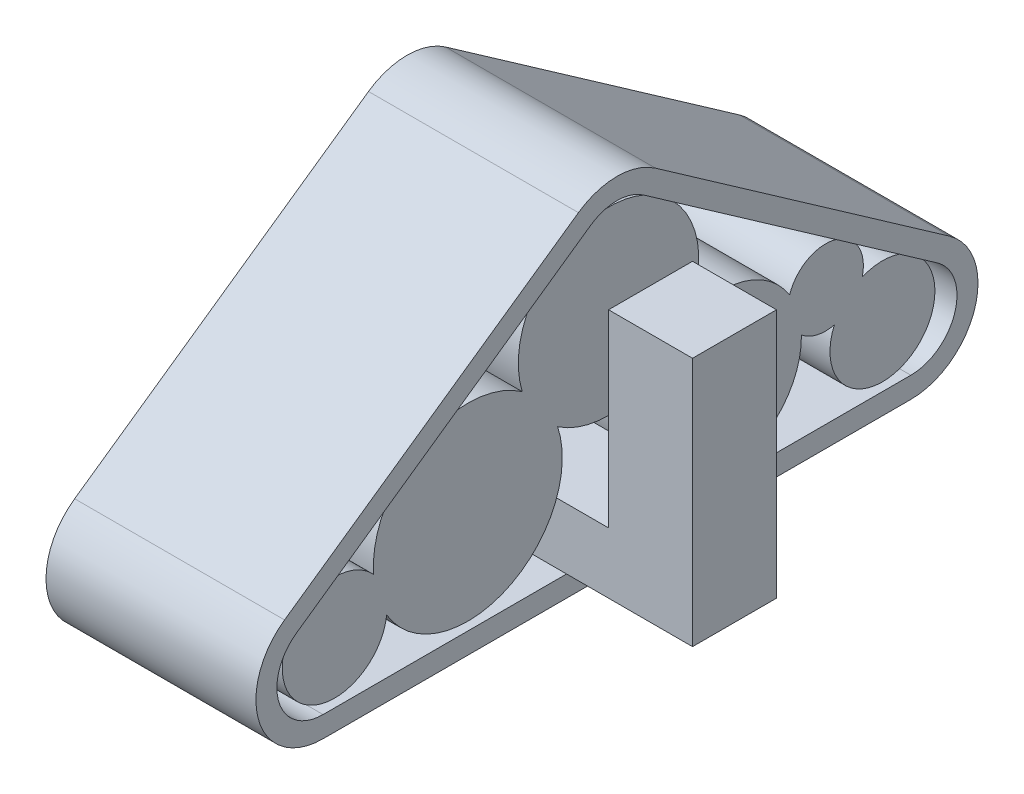
ISO-10303-21;
HEADER;
FILE_DESCRIPTION(('STEP AP214'),'2;1');
FILE_NAME('part.step','',(''),(''),'','','');
FILE_SCHEMA(('AUTOMOTIVE_DESIGN { 1 0 10303 214 1 1 1 1 }'));
ENDSEC;
DATA;
#1=APPLICATION_CONTEXT('core data for automotive mechanical design processes');
#2=APPLICATION_PROTOCOL_DEFINITION('international standard','automotive_design',2000,#1);
#3=PRODUCT_CONTEXT('',#1,'mechanical');
#4=PRODUCT('Part','Part','',(#3));
#5=PRODUCT_RELATED_PRODUCT_CATEGORY('part','',(#4));
#6=PRODUCT_DEFINITION_FORMATION('','',#4);
#7=PRODUCT_DEFINITION_CONTEXT('part definition',#1,'design');
#8=PRODUCT_DEFINITION('design','',#6,#7);
#9=PRODUCT_DEFINITION_SHAPE('','',#8);
#10=(LENGTH_UNIT() NAMED_UNIT(*) SI_UNIT(.MILLI.,.METRE.));
#11=(NAMED_UNIT(*) PLANE_ANGLE_UNIT() SI_UNIT($,.RADIAN.));
#12=(NAMED_UNIT(*) SI_UNIT($,.STERADIAN.) SOLID_ANGLE_UNIT());
#13=UNCERTAINTY_MEASURE_WITH_UNIT(LENGTH_MEASURE(1.E-05),#10,'distance_accuracy_value','');
#14=(GEOMETRIC_REPRESENTATION_CONTEXT(3) GLOBAL_UNCERTAINTY_ASSIGNED_CONTEXT((#13)) GLOBAL_UNIT_ASSIGNED_CONTEXT((#10,
#11,#12)) REPRESENTATION_CONTEXT('',''));
#15=CARTESIAN_POINT('',(0.,0.,0.));
#16=DIRECTION('',(0.,0.,1.));
#17=DIRECTION('',(1.,0.,0.));
#18=AXIS2_PLACEMENT_3D('',#15,#16,#17);
#19=CARTESIAN_POINT('',(0.1,0.,0.));
#20=DIRECTION('',(1.,0.,0.));
#21=DIRECTION('',(0.,0.,-1.));
#22=AXIS2_PLACEMENT_3D('',#19,#20,#21);
#23=PLANE('',#22);
#24=CARTESIAN_POINT('',(0.1,2.6098197246342,0.));
#25=DIRECTION('',(1.,0.,0.));
#26=DIRECTION('',(0.,0.,-1.));
#27=AXIS2_PLACEMENT_3D('',#24,#25,#26);
#28=CIRCLE('',#27,1.075);
#29=CARTESIAN_POINT('',(0.1,1.72204305705104,0.606199297669457));
#30=VERTEX_POINT('',#29);
#31=CARTESIAN_POINT('',(0.1,1.66976450324786,-0.521460622429232));
#32=VERTEX_POINT('',#31);
#33=EDGE_CURVE('E663',#30,#32,#28,.T.);
#34=ORIENTED_EDGE('',*,*,#33,.F.);
#35=CARTESIAN_POINT('',(0.1,1.375,1.67633298864114));
#36=DIRECTION('',(1.,0.,0.));
#37=DIRECTION('',(0.,0.,-1.));
#38=AXIS2_PLACEMENT_3D('',#35,#36,#37);
#39=CIRCLE('',#38,1.125);
#40=CARTESIAN_POINT('',(0.1,0.797718656971334,2.64192671842143));
#41=VERTEX_POINT('',#40);
#42=EDGE_CURVE('E689',#41,#30,#39,.T.);
#43=ORIENTED_EDGE('',*,*,#42,.F.);
#44=CARTESIAN_POINT('',(0.1,0.875000000000002,3.26213038982276));
#45=DIRECTION('',(1.,0.,0.));
#46=DIRECTION('',(0.,0.,-1.));
#47=AXIS2_PLACEMENT_3D('',#44,#45,#46);
#48=CIRCLE('',#47,0.625);
#49=CARTESIAN_POINT('',(0.1,1.29403938178154,2.79841604184963));
#50=VERTEX_POINT('',#49);
#51=EDGE_CURVE('E586',#50,#41,#48,.T.);
#52=ORIENTED_EDGE('',*,*,#51,.F.);
#53=CARTESIAN_POINT('',(0.1,2.29411096497886,1.02759572745165));
#54=VERTEX_POINT('',#53);
#55=EDGE_CURVE('E691',#54,#50,#39,.T.);
#56=ORIENTED_EDGE('',*,*,#55,.F.);
#57=CARTESIAN_POINT('',(0.1,2.04620627521986,-0.915404216529112));
#58=VERTEX_POINT('',#57);
#59=EDGE_CURVE('E734',#58,#54,#28,.T.);
#60=ORIENTED_EDGE('',*,*,#59,.F.);
#61=CARTESIAN_POINT('',(0.1,1.2,-1.34718534138119));
#62=DIRECTION('',(1.,0.,0.));
#63=DIRECTION('',(0.,0.,-1.));
#64=AXIS2_PLACEMENT_3D('',#61,#62,#63);
#65=CIRCLE('',#64,0.950000000000001);
#66=CARTESIAN_POINT('',(0.1,1.69821343428876,-2.15606318994314));
#67=VERTEX_POINT('',#66);
#68=EDGE_CURVE('E724',#67,#58,#65,.T.);
#69=ORIENTED_EDGE('',*,*,#68,.F.);
#70=CARTESIAN_POINT('',(0.1,1.56265537250669,-2.5851599294855));
#71=DIRECTION('',(1.,0.,0.));
#72=DIRECTION('',(0.,0.,-1.));
#73=AXIS2_PLACEMENT_3D('',#70,#71,#72);
#74=CIRCLE('',#73,0.45);
#75=CARTESIAN_POINT('',(0.1,1.45172587783847,-3.02127304235033));
#76=VERTEX_POINT('',#75);
#77=EDGE_CURVE('E729',#76,#67,#74,.T.);
#78=ORIENTED_EDGE('',*,*,#77,.F.);
#79=CARTESIAN_POINT('',(0.1,0.875000000000002,-3.26213038982276));
#80=DIRECTION('',(1.,0.,0.));
#81=DIRECTION('',(0.,0.,-1.));
#82=AXIS2_PLACEMENT_3D('',#79,#80,#81);
#83=CIRCLE('',#82,0.625);
#84=CARTESIAN_POINT('',(0.1,1.124858698694,-2.68924677975266));
#85=VERTEX_POINT('',#84);
#86=EDGE_CURVE('E728',#76,#85,#83,.F.);
#87=ORIENTED_EDGE('',*,*,#86,.T.);
#88=CARTESIAN_POINT('',(0.1,1.2169921219537,-2.2970333649047));
#89=VERTEX_POINT('',#88);
#90=EDGE_CURVE('E723',#89,#85,#74,.T.);
#91=ORIENTED_EDGE('',*,*,#90,.F.);
#92=EDGE_CURVE('E720',#32,#89,#65,.T.);
#93=ORIENTED_EDGE('',*,*,#92,.F.);
#94=EDGE_LOOP('',(#34,#43,#52,#56,#60,#69,#78,#87,#91,#93));
#95=FACE_BOUND('',#94,.T.);
#96=ADVANCED_FACE('F567',(#95),#23,.F.);
#97=CARTESIAN_POINT('',(2.4,2.6098197246342,0.));
#98=DIRECTION('',(-1.,0.,0.));
#99=DIRECTION('',(0.,0.,1.));
#100=AXIS2_PLACEMENT_3D('',#97,#98,#99);
#101=CYLINDRICAL_SURFACE('',#100,1.075);
#102=DIRECTION('',(-1.,0.,0.));
#103=VECTOR('',#102,1.);
#104=CARTESIAN_POINT('',(2.4,1.72204305705104,0.606199297669457));
#105=LINE('',#104,#103);
#106=CARTESIAN_POINT('',(2.4,1.72204305705104,0.606199297669456));
#107=VERTEX_POINT('',#106);
#108=EDGE_CURVE('E700',#107,#30,#105,.T.);
#109=ORIENTED_EDGE('',*,*,#108,.T.);
#110=ORIENTED_EDGE('',*,*,#33,.T.);
#111=DIRECTION('',(-1.,0.,0.));
#112=VECTOR('',#111,1.);
#113=CARTESIAN_POINT('',(2.4,1.66976450324786,-0.521460622429232));
#114=LINE('',#113,#112);
#115=CARTESIAN_POINT('',(2.4,1.66976450324786,-0.521460622429232));
#116=VERTEX_POINT('',#115);
#117=EDGE_CURVE('E656',#116,#32,#114,.T.);
#118=ORIENTED_EDGE('',*,*,#117,.F.);
#119=CARTESIAN_POINT('',(2.4,2.6098197246342,0.));
#120=DIRECTION('',(1.,0.,0.));
#121=DIRECTION('',(0.,0.,-1.));
#122=AXIS2_PLACEMENT_3D('',#119,#120,#121);
#123=CIRCLE('',#122,1.075);
#124=EDGE_CURVE('E660',#107,#116,#123,.T.);
#125=ORIENTED_EDGE('',*,*,#124,.F.);
#126=EDGE_LOOP('',(#109,#110,#118,#125));
#127=FACE_BOUND('',#126,.T.);
#128=ADVANCED_FACE('F658',(#127),#101,.T.);
#129=CARTESIAN_POINT('',(2.4,0.,0.));
#130=DIRECTION('',(1.,0.,0.));
#131=DIRECTION('',(0.,0.,-1.));
#132=AXIS2_PLACEMENT_3D('',#129,#130,#131);
#133=PLANE('',#132);
#134=CARTESIAN_POINT('',(2.4,2.04620627521986,-0.915404216529112));
#135=VERTEX_POINT('',#134);
#136=CARTESIAN_POINT('',(2.4,2.29411096497886,1.02759572745165));
#137=VERTEX_POINT('',#136);
#138=EDGE_CURVE('E685',#135,#137,#123,.T.);
#139=ORIENTED_EDGE('',*,*,#138,.T.);
#140=CARTESIAN_POINT('',(2.4,1.375,1.67633298864114));
#141=DIRECTION('',(1.,0.,0.));
#142=DIRECTION('',(0.,0.,-1.));
#143=AXIS2_PLACEMENT_3D('',#140,#141,#142);
#144=CIRCLE('',#143,1.125);
#145=CARTESIAN_POINT('',(2.4,1.29403938178154,2.79841604184963));
#146=VERTEX_POINT('',#145);
#147=EDGE_CURVE('E696',#137,#146,#144,.T.);
#148=ORIENTED_EDGE('',*,*,#147,.T.);
#149=CARTESIAN_POINT('',(2.4,0.875000000000002,3.26213038982276));
#150=DIRECTION('',(1.,0.,0.));
#151=DIRECTION('',(0.,0.,-1.));
#152=AXIS2_PLACEMENT_3D('',#149,#150,#151);
#153=CIRCLE('',#152,0.625);
#154=CARTESIAN_POINT('',(2.4,0.797718656971334,2.64192671842143));
#155=VERTEX_POINT('',#154);
#156=EDGE_CURVE('E706',#146,#155,#153,.T.);
#157=ORIENTED_EDGE('',*,*,#156,.T.);
#158=EDGE_CURVE('E683',#155,#107,#144,.T.);
#159=ORIENTED_EDGE('',*,*,#158,.T.);
#160=ORIENTED_EDGE('',*,*,#124,.T.);
#161=CARTESIAN_POINT('',(2.4,1.2,-1.34718534138119));
#162=DIRECTION('',(1.,0.,0.));
#163=DIRECTION('',(0.,0.,-1.));
#164=AXIS2_PLACEMENT_3D('',#161,#162,#163);
#165=CIRCLE('',#164,0.950000000000001);
#166=CARTESIAN_POINT('',(2.4,1.2169921219537,-2.2970333649047));
#167=VERTEX_POINT('',#166);
#168=EDGE_CURVE('E670',#116,#167,#165,.T.);
#169=ORIENTED_EDGE('',*,*,#168,.T.);
#170=CARTESIAN_POINT('',(2.4,1.56265537250669,-2.5851599294855));
#171=DIRECTION('',(1.,0.,0.));
#172=DIRECTION('',(0.,0.,-1.));
#173=AXIS2_PLACEMENT_3D('',#170,#171,#172);
#174=CIRCLE('',#173,0.45);
#175=CARTESIAN_POINT('',(2.4,1.124858698694,-2.68924677975266));
#176=VERTEX_POINT('',#175);
#177=EDGE_CURVE('E676',#167,#176,#174,.T.);
#178=ORIENTED_EDGE('',*,*,#177,.T.);
#179=CARTESIAN_POINT('',(2.4,0.875000000000002,-3.26213038982276));
#180=DIRECTION('',(1.,0.,0.));
#181=DIRECTION('',(0.,0.,-1.));
#182=AXIS2_PLACEMENT_3D('',#179,#180,#181);
#183=CIRCLE('',#182,0.625);
#184=CARTESIAN_POINT('',(2.4,1.45172587783847,-3.02127304235033));
#185=VERTEX_POINT('',#184);
#186=EDGE_CURVE('E715',#185,#176,#183,.F.);
#187=ORIENTED_EDGE('',*,*,#186,.F.);
#188=CARTESIAN_POINT('',(2.4,1.69821343428876,-2.15606318994314));
#189=VERTEX_POINT('',#188);
#190=EDGE_CURVE('E716',#185,#189,#174,.T.);
#191=ORIENTED_EDGE('',*,*,#190,.T.);
#192=EDGE_CURVE('E678',#189,#135,#165,.T.);
#193=ORIENTED_EDGE('',*,*,#192,.T.);
#194=EDGE_LOOP('',(#139,#148,#157,#159,#160,#169,#178,#187,#191,#193));
#195=FACE_BOUND('',#194,.T.);
#196=ADVANCED_FACE('F680',(#195),#133,.T.);
#197=DIRECTION('',(-1.,0.,0.));
#198=VECTOR('',#197,1.);
#199=CARTESIAN_POINT('',(2.4,2.04620627521986,-0.915404216529112));
#200=LINE('',#199,#198);
#201=EDGE_CURVE('E630',#135,#58,#200,.T.);
#202=ORIENTED_EDGE('',*,*,#201,.T.);
#203=ORIENTED_EDGE('',*,*,#59,.T.);
#204=DIRECTION('',(-1.,0.,0.));
#205=VECTOR('',#204,1.);
#206=CARTESIAN_POINT('',(2.4,2.29411096497886,1.02759572745165));
#207=LINE('',#206,#205);
#208=EDGE_CURVE('E703',#137,#54,#207,.T.);
#209=ORIENTED_EDGE('',*,*,#208,.F.);
#210=ORIENTED_EDGE('',*,*,#138,.F.);
#211=EDGE_LOOP('',(#202,#203,#209,#210));
#212=FACE_BOUND('',#211,.T.);
#213=ADVANCED_FACE('F777',(#212),#101,.T.);
#214=CARTESIAN_POINT('',(0.1,0.875000000000002,-3.26213038982276));
#215=DIRECTION('',(1.,0.,0.));
#216=DIRECTION('',(0.,0.,-1.));
#217=AXIS2_PLACEMENT_3D('',#214,#215,#216);
#218=CYLINDRICAL_SURFACE('',#217,0.625);
#219=DIRECTION('',(1.,0.,0.));
#220=VECTOR('',#219,1.);
#221=CARTESIAN_POINT('',(0.1,1.45172587783847,-3.02127304235033));
#222=LINE('',#221,#220);
#223=EDGE_CURVE('E614',#76,#185,#222,.T.);
#224=ORIENTED_EDGE('',*,*,#223,.T.);
#225=ORIENTED_EDGE('',*,*,#186,.T.);
#226=DIRECTION('',(1.,0.,0.));
#227=VECTOR('',#226,1.);
#228=CARTESIAN_POINT('',(0.1,1.124858698694,-2.68924677975266));
#229=LINE('',#228,#227);
#230=EDGE_CURVE('E736',#85,#176,#229,.T.);
#231=ORIENTED_EDGE('',*,*,#230,.F.);
#232=ORIENTED_EDGE('',*,*,#86,.F.);
#233=EDGE_LOOP('',(#224,#225,#231,#232));
#234=FACE_BOUND('',#233,.T.);
#235=ADVANCED_FACE('F569',(#234),#218,.T.);
#236=CARTESIAN_POINT('',(0.1,1.56265537250669,-2.5851599294855));
#237=DIRECTION('',(1.,0.,0.));
#238=DIRECTION('',(0.,0.,-1.));
#239=AXIS2_PLACEMENT_3D('',#236,#237,#238);
#240=CYLINDRICAL_SURFACE('',#239,0.45);
#241=DIRECTION('',(1.,0.,0.));
#242=VECTOR('',#241,1.);
#243=CARTESIAN_POINT('',(0.1,1.69821343428876,-2.15606318994314));
#244=LINE('',#243,#242);
#245=EDGE_CURVE('E621',#67,#189,#244,.T.);
#246=ORIENTED_EDGE('',*,*,#245,.T.);
#247=ORIENTED_EDGE('',*,*,#190,.F.);
#248=ORIENTED_EDGE('',*,*,#223,.F.);
#249=ORIENTED_EDGE('',*,*,#77,.T.);
#250=EDGE_LOOP('',(#246,#247,#248,#249));
#251=FACE_BOUND('',#250,.T.);
#252=ADVANCED_FACE('F749',(#251),#240,.T.);
#253=ORIENTED_EDGE('',*,*,#230,.T.);
#254=ORIENTED_EDGE('',*,*,#177,.F.);
#255=DIRECTION('',(1.,0.,0.));
#256=VECTOR('',#255,1.);
#257=CARTESIAN_POINT('',(0.1,1.2169921219537,-2.2970333649047));
#258=LINE('',#257,#256);
#259=EDGE_CURVE('E571',#89,#167,#258,.T.);
#260=ORIENTED_EDGE('',*,*,#259,.F.);
#261=ORIENTED_EDGE('',*,*,#90,.T.);
#262=EDGE_LOOP('',(#253,#254,#260,#261));
#263=FACE_BOUND('',#262,.T.);
#264=ADVANCED_FACE('F768',(#263),#240,.T.);
#265=CARTESIAN_POINT('',(0.1,1.2,-1.34718534138119));
#266=DIRECTION('',(1.,0.,0.));
#267=DIRECTION('',(0.,0.,-1.));
#268=AXIS2_PLACEMENT_3D('',#265,#266,#267);
#269=CYLINDRICAL_SURFACE('',#268,0.950000000000001);
#270=ORIENTED_EDGE('',*,*,#259,.T.);
#271=ORIENTED_EDGE('',*,*,#168,.F.);
#272=ORIENTED_EDGE('',*,*,#117,.T.);
#273=ORIENTED_EDGE('',*,*,#92,.T.);
#274=EDGE_LOOP('',(#270,#271,#272,#273));
#275=FACE_BOUND('',#274,.T.);
#276=ADVANCED_FACE('F671',(#275),#269,.T.);
#277=ORIENTED_EDGE('',*,*,#201,.F.);
#278=ORIENTED_EDGE('',*,*,#192,.F.);
#279=ORIENTED_EDGE('',*,*,#245,.F.);
#280=ORIENTED_EDGE('',*,*,#68,.T.);
#281=EDGE_LOOP('',(#277,#278,#279,#280));
#282=FACE_BOUND('',#281,.T.);
#283=ADVANCED_FACE('F793',(#282),#269,.T.);
#284=CARTESIAN_POINT('',(0.1,0.875000000000002,3.26213038982276));
#285=DIRECTION('',(1.,0.,0.));
#286=DIRECTION('',(0.,0.,-1.));
#287=AXIS2_PLACEMENT_3D('',#284,#285,#286);
#288=CYLINDRICAL_SURFACE('',#287,0.625);
#289=DIRECTION('',(1.,0.,0.));
#290=VECTOR('',#289,1.);
#291=CARTESIAN_POINT('',(0.1,0.797718656971334,2.64192671842143));
#292=LINE('',#291,#290);
#293=EDGE_CURVE('E13',#41,#155,#292,.T.);
#294=ORIENTED_EDGE('',*,*,#293,.T.);
#295=ORIENTED_EDGE('',*,*,#156,.F.);
#296=DIRECTION('',(1.,0.,0.));
#297=VECTOR('',#296,1.);
#298=CARTESIAN_POINT('',(0.1,1.29403938178154,2.79841604184963));
#299=LINE('',#298,#297);
#300=EDGE_CURVE('E578',#50,#146,#299,.T.);
#301=ORIENTED_EDGE('',*,*,#300,.F.);
#302=ORIENTED_EDGE('',*,*,#51,.T.);
#303=EDGE_LOOP('',(#294,#295,#301,#302));
#304=FACE_BOUND('',#303,.T.);
#305=ADVANCED_FACE('F780',(#304),#288,.T.);
#306=CARTESIAN_POINT('',(2.4,1.375,1.67633298864114));
#307=DIRECTION('',(-1.,0.,0.));
#308=DIRECTION('',(0.,0.,1.));
#309=AXIS2_PLACEMENT_3D('',#306,#307,#308);
#310=CYLINDRICAL_SURFACE('',#309,1.125);
#311=ORIENTED_EDGE('',*,*,#208,.T.);
#312=ORIENTED_EDGE('',*,*,#55,.T.);
#313=ORIENTED_EDGE('',*,*,#300,.T.);
#314=ORIENTED_EDGE('',*,*,#147,.F.);
#315=EDGE_LOOP('',(#311,#312,#313,#314));
#316=FACE_BOUND('',#315,.T.);
#317=ADVANCED_FACE('F778',(#316),#310,.T.);
#318=ORIENTED_EDGE('',*,*,#158,.F.);
#319=ORIENTED_EDGE('',*,*,#293,.F.);
#320=ORIENTED_EDGE('',*,*,#42,.T.);
#321=ORIENTED_EDGE('',*,*,#108,.F.);
#322=EDGE_LOOP('',(#318,#319,#320,#321));
#323=FACE_BOUND('',#322,.T.);
#324=ADVANCED_FACE('F767',(#323),#310,.T.);
#325=CLOSED_SHELL('',(#96,#128,#196,#213,#235,#252,#264,#276,#283,#305,#317,#324));
#326=MANIFOLD_SOLID_BREP('B2',#325);
#327=CARTESIAN_POINT('',(0.,0.975000000000002,0.));
#328=DIRECTION('',(0.,1.,0.));
#329=DIRECTION('',(0.,0.,1.));
#330=AXIS2_PLACEMENT_3D('',#327,#328,#329);
#331=PLANE('',#330);
#332=DIRECTION('',(1.,0.,0.));
#333=VECTOR('',#332,1.);
#334=CARTESIAN_POINT('',(0.,0.975000000000002,0.6));
#335=LINE('',#334,#333);
#336=CARTESIAN_POINT('',(0.,0.975000000000002,0.6));
#337=VERTEX_POINT('',#336);
#338=CARTESIAN_POINT('',(3.,0.975000000000002,0.6));
#339=VERTEX_POINT('',#338);
#340=EDGE_CURVE('E1165',#337,#339,#335,.T.);
#341=ORIENTED_EDGE('',*,*,#340,.T.);
#342=DIRECTION('',(0.,0.,1.));
#343=VECTOR('',#342,1.);
#344=CARTESIAN_POINT('',(3.,0.975000000000002,-0.4));
#345=LINE('',#344,#343);
#346=CARTESIAN_POINT('',(3.,0.975000000000002,-0.4));
#347=VERTEX_POINT('',#346);
#348=EDGE_CURVE('E1124',#347,#339,#345,.T.);
#349=ORIENTED_EDGE('',*,*,#348,.F.);
#350=DIRECTION('',(1.,0.,0.));
#351=VECTOR('',#350,1.);
#352=CARTESIAN_POINT('',(0.,0.975000000000002,-0.4));
#353=LINE('',#352,#351);
#354=CARTESIAN_POINT('',(0.,0.975000000000002,-0.4));
#355=VERTEX_POINT('',#354);
#356=EDGE_CURVE('E1155',#355,#347,#353,.T.);
#357=ORIENTED_EDGE('',*,*,#356,.F.);
#358=DIRECTION('',(0.,0.,1.));
#359=VECTOR('',#358,1.);
#360=CARTESIAN_POINT('',(0.,0.975000000000002,0.));
#361=LINE('',#360,#359);
#362=EDGE_CURVE('E1148',#355,#337,#361,.T.);
#363=ORIENTED_EDGE('',*,*,#362,.T.);
#364=EDGE_LOOP('',(#341,#349,#357,#363));
#365=FACE_BOUND('',#364,.T.);
#366=ADVANCED_FACE('F961',(#365),#331,.T.);
#367=CARTESIAN_POINT('',(2.5,0.250000000000001,0.));
#368=DIRECTION('',(0.,-1.,0.));
#369=DIRECTION('',(0.,0.,-1.));
#370=AXIS2_PLACEMENT_3D('',#367,#368,#369);
#371=PLANE('',#370);
#372=DIRECTION('',(1.,0.,0.));
#373=VECTOR('',#372,1.);
#374=CARTESIAN_POINT('',(0.,0.250000000000002,0.6));
#375=LINE('',#374,#373);
#376=CARTESIAN_POINT('',(0.,0.250000000000002,0.6));
#377=VERTEX_POINT('',#376);
#378=CARTESIAN_POINT('',(2.5,0.250000000000001,0.6));
#379=VERTEX_POINT('',#378);
#380=EDGE_CURVE('E1160',#377,#379,#375,.T.);
#381=ORIENTED_EDGE('',*,*,#380,.F.);
#382=DIRECTION('',(0.,0.,1.));
#383=VECTOR('',#382,1.);
#384=CARTESIAN_POINT('',(0.,0.250000000000001,0.));
#385=LINE('',#384,#383);
#386=CARTESIAN_POINT('',(0.,0.250000000000001,3.5));
#387=VERTEX_POINT('',#386);
#388=EDGE_CURVE('E1209',#377,#387,#385,.T.);
#389=ORIENTED_EDGE('',*,*,#388,.T.);
#390=DIRECTION('',(-1.,0.,0.));
#391=VECTOR('',#390,1.);
#392=CARTESIAN_POINT('',(2.5,0.250000000000001,3.5));
#393=LINE('',#392,#391);
#394=CARTESIAN_POINT('',(2.5,0.250000000000001,3.5));
#395=VERTEX_POINT('',#394);
#396=EDGE_CURVE('E1222',#395,#387,#393,.T.);
#397=ORIENTED_EDGE('',*,*,#396,.F.);
#398=DIRECTION('',(0.,0.,1.));
#399=VECTOR('',#398,1.);
#400=CARTESIAN_POINT('',(2.5,0.250000000000001,0.));
#401=LINE('',#400,#399);
#402=EDGE_CURVE('E979',#379,#395,#401,.T.);
#403=ORIENTED_EDGE('',*,*,#402,.F.);
#404=EDGE_LOOP('',(#381,#389,#397,#403));
#405=FACE_BOUND('',#404,.T.);
#406=ADVANCED_FACE('F1331',(#405),#371,.F.);
#407=CARTESIAN_POINT('',(2.5,0.800000000000001,3.5));
#408=DIRECTION('',(-1.,0.,0.));
#409=DIRECTION('',(0.,0.,1.));
#410=AXIS2_PLACEMENT_3D('',#407,#408,#409);
#411=CYLINDRICAL_SURFACE('',#410,0.8);
#412=CARTESIAN_POINT('',(0.,0.800000000000001,3.5));
#413=DIRECTION('',(-1.,0.,0.));
#414=DIRECTION('',(0.,0.,1.));
#415=AXIS2_PLACEMENT_3D('',#412,#413,#414);
#416=CIRCLE('',#415,0.8);
#417=CARTESIAN_POINT('',(0.,0.,3.5));
#418=VERTEX_POINT('',#417);
#419=CARTESIAN_POINT('',(0.,1.4553216354312,3.95886114908083));
#420=VERTEX_POINT('',#419);
#421=EDGE_CURVE('E1235',#418,#420,#416,.T.);
#422=ORIENTED_EDGE('',*,*,#421,.F.);
#423=DIRECTION('',(-1.,0.,0.));
#424=VECTOR('',#423,1.);
#425=CARTESIAN_POINT('',(2.5,0.,3.5));
#426=LINE('',#425,#424);
#427=CARTESIAN_POINT('',(2.5,0.,3.5));
#428=VERTEX_POINT('',#427);
#429=EDGE_CURVE('E565',#428,#418,#426,.T.);
#430=ORIENTED_EDGE('',*,*,#429,.F.);
#431=CARTESIAN_POINT('',(2.5,0.800000000000001,3.5));
#432=DIRECTION('',(-1.,0.,0.));
#433=DIRECTION('',(0.,0.,1.));
#434=AXIS2_PLACEMENT_3D('',#431,#432,#433);
#435=CIRCLE('',#434,0.8);
#436=CARTESIAN_POINT('',(2.5,1.4553216354312,3.95886114908083));
#437=VERTEX_POINT('',#436);
#438=EDGE_CURVE('E1236',#428,#437,#435,.T.);
#439=ORIENTED_EDGE('',*,*,#438,.T.);
#440=DIRECTION('',(-1.,0.,0.));
#441=VECTOR('',#440,1.);
#442=CARTESIAN_POINT('',(2.5,1.4553216354312,3.95886114908083));
#443=LINE('',#442,#441);
#444=EDGE_CURVE('E965',#437,#420,#443,.T.);
#445=ORIENTED_EDGE('',*,*,#444,.T.);
#446=EDGE_LOOP('',(#422,#430,#439,#445));
#447=FACE_BOUND('',#446,.T.);
#448=ADVANCED_FACE('F963',(#447),#411,.T.);
#449=CARTESIAN_POINT('',(2.5,0.,3.));
#450=DIRECTION('',(0.,-1.,0.));
#451=DIRECTION('',(0.,0.,-1.));
#452=AXIS2_PLACEMENT_3D('',#449,#450,#451);
#453=PLANE('',#452);
#454=DIRECTION('',(0.,0.,1.));
#455=VECTOR('',#454,1.);
#456=CARTESIAN_POINT('',(0.,0.,3.));
#457=LINE('',#456,#455);
#458=CARTESIAN_POINT('',(0.,0.,-3.5));
#459=VERTEX_POINT('',#458);
#460=EDGE_CURVE('E1241',#459,#418,#457,.T.);
#461=ORIENTED_EDGE('',*,*,#460,.F.);
#462=DIRECTION('',(-1.,0.,0.));
#463=VECTOR('',#462,1.);
#464=CARTESIAN_POINT('',(2.5,0.,-3.5));
#465=LINE('',#464,#463);
#466=CARTESIAN_POINT('',(2.5,0.,-3.5));
#467=VERTEX_POINT('',#466);
#468=EDGE_CURVE('E971',#467,#459,#465,.T.);
#469=ORIENTED_EDGE('',*,*,#468,.F.);
#470=DIRECTION('',(0.,0.,-1.));
#471=VECTOR('',#470,1.);
#472=CARTESIAN_POINT('',(2.5,0.,-3.));
#473=LINE('',#472,#471);
#474=EDGE_CURVE('E1256',#428,#467,#473,.T.);
#475=ORIENTED_EDGE('',*,*,#474,.F.);
#476=ORIENTED_EDGE('',*,*,#429,.T.);
#477=EDGE_LOOP('',(#461,#469,#475,#476));
#478=FACE_BOUND('',#477,.T.);
#479=ADVANCED_FACE('F1309',(#478),#453,.T.);
#480=CARTESIAN_POINT('',(2.5,0.800000000000002,-3.5));
#481=DIRECTION('',(-1.,0.,0.));
#482=DIRECTION('',(0.,0.,1.));
#483=AXIS2_PLACEMENT_3D('',#480,#481,#482);
#484=CYLINDRICAL_SURFACE('',#483,0.8);
#485=CARTESIAN_POINT('',(0.,0.800000000000002,-3.5));
#486=DIRECTION('',(-1.,0.,0.));
#487=DIRECTION('',(0.,0.,1.));
#488=AXIS2_PLACEMENT_3D('',#485,#486,#487);
#489=CIRCLE('',#488,0.8);
#490=CARTESIAN_POINT('',(0.,1.4553216354312,-3.95886114908083));
#491=VERTEX_POINT('',#490);
#492=EDGE_CURVE('E1274',#491,#459,#489,.T.);
#493=ORIENTED_EDGE('',*,*,#492,.F.);
#494=DIRECTION('',(-1.,0.,0.));
#495=VECTOR('',#494,1.);
#496=CARTESIAN_POINT('',(2.5,1.4553216354312,-3.95886114908083));
#497=LINE('',#496,#495);
#498=CARTESIAN_POINT('',(2.5,1.4553216354312,-3.95886114908083));
#499=VERTEX_POINT('',#498);
#500=EDGE_CURVE('E1284',#499,#491,#497,.T.);
#501=ORIENTED_EDGE('',*,*,#500,.F.);
#502=CARTESIAN_POINT('',(2.5,0.800000000000002,-3.5));
#503=DIRECTION('',(-1.,0.,0.));
#504=DIRECTION('',(0.,0.,1.));
#505=AXIS2_PLACEMENT_3D('',#502,#503,#504);
#506=CIRCLE('',#505,0.8);
#507=EDGE_CURVE('E1252',#499,#467,#506,.T.);
#508=ORIENTED_EDGE('',*,*,#507,.T.);
#509=ORIENTED_EDGE('',*,*,#468,.T.);
#510=EDGE_LOOP('',(#493,#501,#508,#509));
#511=FACE_BOUND('',#510,.T.);
#512=ADVANCED_FACE('F1311',(#511),#484,.T.);
#513=CARTESIAN_POINT('',(2.5,1.4553216354312,-3.95886114908083));
#514=DIRECTION('',(0.,-0.819152044288995,0.573576436351042));
#515=DIRECTION('',(0.,-0.573576436351042,-0.819152044288995));
#516=AXIS2_PLACEMENT_3D('',#513,#514,#515);
#517=PLANE('',#516);
#518=DIRECTION('',(0.,0.573576436351042,0.819152044288995));
#519=VECTOR('',#518,1.);
#520=CARTESIAN_POINT('',(0.,1.4553216354312,-3.95886114908083));
#521=LINE('',#520,#519);
#522=CARTESIAN_POINT('',(0.,3.90604801916515,-0.458861149080833));
#523=VERTEX_POINT('',#522);
#524=EDGE_CURVE('E1270',#491,#523,#521,.T.);
#525=ORIENTED_EDGE('',*,*,#524,.T.);
#526=DIRECTION('',(-1.,0.,0.));
#527=VECTOR('',#526,1.);
#528=CARTESIAN_POINT('',(2.5,3.90604801916515,-0.458861149080833));
#529=LINE('',#528,#527);
#530=CARTESIAN_POINT('',(2.5,3.90604801916515,-0.458861149080833));
#531=VERTEX_POINT('',#530);
#532=EDGE_CURVE('E1287',#531,#523,#529,.T.);
#533=ORIENTED_EDGE('',*,*,#532,.F.);
#534=DIRECTION('',(0.,0.573576436351042,0.819152044288995));
#535=VECTOR('',#534,1.);
#536=CARTESIAN_POINT('',(2.5,1.4553216354312,-3.95886114908083));
#537=LINE('',#536,#535);
#538=EDGE_CURVE('E1249',#499,#531,#537,.T.);
#539=ORIENTED_EDGE('',*,*,#538,.F.);
#540=ORIENTED_EDGE('',*,*,#500,.T.);
#541=EDGE_LOOP('',(#525,#533,#539,#540));
#542=FACE_BOUND('',#541,.T.);
#543=ADVANCED_FACE('F1321',(#542),#517,.F.);
#544=CARTESIAN_POINT('',(2.5,3.25072638373396,0.));
#545=DIRECTION('',(-1.,0.,0.));
#546=DIRECTION('',(0.,0.,1.));
#547=AXIS2_PLACEMENT_3D('',#544,#545,#546);
#548=CYLINDRICAL_SURFACE('',#547,0.799999999999999);
#549=CARTESIAN_POINT('',(0.,3.25072638373396,0.));
#550=DIRECTION('',(-1.,0.,0.));
#551=DIRECTION('',(0.,0.,1.));
#552=AXIS2_PLACEMENT_3D('',#549,#550,#551);
#553=CIRCLE('',#552,0.799999999999999);
#554=CARTESIAN_POINT('',(0.,3.90604801916515,0.458861149080833));
#555=VERTEX_POINT('',#554);
#556=EDGE_CURVE('E1266',#555,#523,#553,.T.);
#557=ORIENTED_EDGE('',*,*,#556,.F.);
#558=DIRECTION('',(-1.,0.,0.));
#559=VECTOR('',#558,1.);
#560=CARTESIAN_POINT('',(2.5,3.90604801916515,0.458861149080833));
#561=LINE('',#560,#559);
#562=CARTESIAN_POINT('',(2.5,3.90604801916515,0.458861149080833));
#563=VERTEX_POINT('',#562);
#564=EDGE_CURVE('E1289',#563,#555,#561,.T.);
#565=ORIENTED_EDGE('',*,*,#564,.F.);
#566=CARTESIAN_POINT('',(2.5,3.25072638373396,0.));
#567=DIRECTION('',(-1.,0.,0.));
#568=DIRECTION('',(0.,0.,1.));
#569=AXIS2_PLACEMENT_3D('',#566,#567,#568);
#570=CIRCLE('',#569,0.799999999999999);
#571=EDGE_CURVE('E1245',#563,#531,#570,.T.);
#572=ORIENTED_EDGE('',*,*,#571,.T.);
#573=ORIENTED_EDGE('',*,*,#532,.T.);
#574=EDGE_LOOP('',(#557,#565,#572,#573));
#575=FACE_BOUND('',#574,.T.);
#576=ADVANCED_FACE('F1319',(#575),#548,.T.);
#577=CARTESIAN_POINT('',(2.5,1.4553216354312,3.95886114908083));
#578=DIRECTION('',(0.,0.819152044288995,0.573576436351042));
#579=DIRECTION('',(0.,-0.573576436351042,0.819152044288995));
#580=AXIS2_PLACEMENT_3D('',#577,#578,#579);
#581=PLANE('',#580);
#582=DIRECTION('',(0.,0.573576436351042,-0.819152044288995));
#583=VECTOR('',#582,1.);
#584=CARTESIAN_POINT('',(0.,1.4553216354312,3.95886114908083));
#585=LINE('',#584,#583);
#586=EDGE_CURVE('E1262',#420,#555,#585,.T.);
#587=ORIENTED_EDGE('',*,*,#586,.F.);
#588=ORIENTED_EDGE('',*,*,#444,.F.);
#589=DIRECTION('',(0.,0.573576436351042,-0.819152044288995));
#590=VECTOR('',#589,1.);
#591=CARTESIAN_POINT('',(2.5,1.4553216354312,3.95886114908083));
#592=LINE('',#591,#590);
#593=EDGE_CURVE('E1240',#437,#563,#592,.T.);
#594=ORIENTED_EDGE('',*,*,#593,.T.);
#595=ORIENTED_EDGE('',*,*,#564,.T.);
#596=EDGE_LOOP('',(#587,#588,#594,#595));
#597=FACE_BOUND('',#596,.T.);
#598=ADVANCED_FACE('F1302',(#597),#581,.T.);
#599=CARTESIAN_POINT('',(2.5,0.800000000000001,3.5));
#600=DIRECTION('',(-1.,0.,0.));
#601=DIRECTION('',(0.,0.,1.));
#602=AXIS2_PLACEMENT_3D('',#599,#600,#601);
#603=PLANE('',#602);
#604=CARTESIAN_POINT('',(2.5,3.25072638373396,0.));
#605=DIRECTION('',(1.,0.,0.));
#606=DIRECTION('',(0.,0.,-1.));
#607=AXIS2_PLACEMENT_3D('',#604,#605,#606);
#608=CIRCLE('',#607,0.55);
#609=CARTESIAN_POINT('',(2.5,3.70126000809291,-0.315467039993072));
#610=VERTEX_POINT('',#609);
#611=CARTESIAN_POINT('',(2.5,3.70126000809291,0.315467039993072));
#612=VERTEX_POINT('',#611);
#613=EDGE_CURVE('E1175',#610,#612,#608,.T.);
#614=ORIENTED_EDGE('',*,*,#613,.F.);
#615=DIRECTION('',(0.,-0.573576436351042,-0.819152044288995));
#616=VECTOR('',#615,1.);
#617=CARTESIAN_POINT('',(2.5,2.63180376806455,-1.8428088374875));
#618=LINE('',#617,#616);
#619=CARTESIAN_POINT('',(2.5,1.25053362435895,-3.81546703999307));
#620=VERTEX_POINT('',#619);
#621=EDGE_CURVE('E1171',#610,#620,#618,.T.);
#622=ORIENTED_EDGE('',*,*,#621,.T.);
#623=CARTESIAN_POINT('',(2.5,0.800000000000002,-3.5));
#624=DIRECTION('',(1.,0.,0.));
#625=DIRECTION('',(0.,0.,-1.));
#626=AXIS2_PLACEMENT_3D('',#623,#624,#625);
#627=CIRCLE('',#626,0.55);
#628=CARTESIAN_POINT('',(2.5,0.250000000000002,-3.5));
#629=VERTEX_POINT('',#628);
#630=EDGE_CURVE('E1189',#620,#629,#627,.F.);
#631=ORIENTED_EDGE('',*,*,#630,.T.);
#632=CARTESIAN_POINT('',(2.5,0.250000000000001,-0.4));
#633=VERTEX_POINT('',#632);
#634=EDGE_CURVE('E1186',#629,#633,#401,.T.);
#635=ORIENTED_EDGE('',*,*,#634,.T.);
#636=EDGE_CURVE('E1190',#633,#379,#401,.T.);
#637=ORIENTED_EDGE('',*,*,#636,.T.);
#638=ORIENTED_EDGE('',*,*,#402,.T.);
#639=CARTESIAN_POINT('',(2.5,0.800000000000001,3.5));
#640=DIRECTION('',(1.,0.,0.));
#641=DIRECTION('',(0.,0.,-1.));
#642=AXIS2_PLACEMENT_3D('',#639,#640,#641);
#643=CIRCLE('',#642,0.55);
#644=CARTESIAN_POINT('',(2.5,1.25053362435895,3.81546703999307));
#645=VERTEX_POINT('',#644);
#646=EDGE_CURVE('E1182',#645,#395,#643,.T.);
#647=ORIENTED_EDGE('',*,*,#646,.F.);
#648=DIRECTION('',(0.,-0.573576436351042,0.819152044288995));
#649=VECTOR('',#648,1.);
#650=CARTESIAN_POINT('',(2.5,2.63180376806455,1.8428088374875));
#651=LINE('',#650,#649);
#652=EDGE_CURVE('E1179',#612,#645,#651,.T.);
#653=ORIENTED_EDGE('',*,*,#652,.F.);
#654=EDGE_LOOP('',(#614,#622,#631,#635,#637,#638,#647,#653));
#655=FACE_BOUND('',#654,.T.);
#656=ORIENTED_EDGE('',*,*,#438,.F.);
#657=ORIENTED_EDGE('',*,*,#474,.T.);
#658=ORIENTED_EDGE('',*,*,#507,.F.);
#659=ORIENTED_EDGE('',*,*,#538,.T.);
#660=ORIENTED_EDGE('',*,*,#571,.F.);
#661=ORIENTED_EDGE('',*,*,#593,.F.);
#662=EDGE_LOOP('',(#656,#657,#658,#659,#660,#661));
#663=FACE_BOUND('',#662,.T.);
#664=ADVANCED_FACE('F1315',(#655,#663),#603,.F.);
#665=CARTESIAN_POINT('',(0.,0.800000000000001,3.5));
#666=DIRECTION('',(-1.,0.,0.));
#667=DIRECTION('',(0.,0.,1.));
#668=AXIS2_PLACEMENT_3D('',#665,#666,#667);
#669=PLANE('',#668);
#670=DIRECTION('',(0.,-0.573576436351042,-0.819152044288995));
#671=VECTOR('',#670,1.);
#672=CARTESIAN_POINT('',(0.,2.63180376806455,-1.8428088374875));
#673=LINE('',#672,#671);
#674=CARTESIAN_POINT('',(0.,3.70126000809291,-0.315467039993072));
#675=VERTEX_POINT('',#674);
#676=CARTESIAN_POINT('',(0.,1.25053362435895,-3.81546703999307));
#677=VERTEX_POINT('',#676);
#678=EDGE_CURVE('E1158',#675,#677,#673,.T.);
#679=ORIENTED_EDGE('',*,*,#678,.F.);
#680=CARTESIAN_POINT('',(0.,3.25072638373396,0.));
#681=DIRECTION('',(1.,0.,0.));
#682=DIRECTION('',(0.,0.,-1.));
#683=AXIS2_PLACEMENT_3D('',#680,#681,#682);
#684=CIRCLE('',#683,0.55);
#685=CARTESIAN_POINT('',(0.,3.70126000809291,0.315467039993072));
#686=VERTEX_POINT('',#685);
#687=EDGE_CURVE('E1197',#675,#686,#684,.T.);
#688=ORIENTED_EDGE('',*,*,#687,.T.);
#689=DIRECTION('',(0.,-0.573576436351042,0.819152044288995));
#690=VECTOR('',#689,1.);
#691=CARTESIAN_POINT('',(0.,2.63180376806455,1.8428088374875));
#692=LINE('',#691,#690);
#693=CARTESIAN_POINT('',(0.,1.25053362435895,3.81546703999307));
#694=VERTEX_POINT('',#693);
#695=EDGE_CURVE('E1201',#686,#694,#692,.T.);
#696=ORIENTED_EDGE('',*,*,#695,.T.);
#697=CARTESIAN_POINT('',(0.,0.800000000000001,3.5));
#698=DIRECTION('',(1.,0.,0.));
#699=DIRECTION('',(0.,0.,-1.));
#700=AXIS2_PLACEMENT_3D('',#697,#698,#699);
#701=CIRCLE('',#700,0.55);
#702=EDGE_CURVE('E1205',#694,#387,#701,.T.);
#703=ORIENTED_EDGE('',*,*,#702,.T.);
#704=ORIENTED_EDGE('',*,*,#388,.F.);
#705=DIRECTION('',(0.,1.,0.));
#706=VECTOR('',#705,1.);
#707=CARTESIAN_POINT('',(0.,0.,0.6));
#708=LINE('',#707,#706);
#709=EDGE_CURVE('E1152',#377,#337,#708,.T.);
#710=ORIENTED_EDGE('',*,*,#709,.T.);
#711=ORIENTED_EDGE('',*,*,#362,.F.);
#712=DIRECTION('',(0.,1.,0.));
#713=VECTOR('',#712,1.);
#714=CARTESIAN_POINT('',(0.,0.,-0.4));
#715=LINE('',#714,#713);
#716=CARTESIAN_POINT('',(0.,0.250000000000001,-0.4));
#717=VERTEX_POINT('',#716);
#718=EDGE_CURVE('E1144',#717,#355,#715,.T.);
#719=ORIENTED_EDGE('',*,*,#718,.F.);
#720=CARTESIAN_POINT('',(0.,0.250000000000002,-3.5));
#721=VERTEX_POINT('',#720);
#722=EDGE_CURVE('E1210',#721,#717,#385,.T.);
#723=ORIENTED_EDGE('',*,*,#722,.F.);
#724=CARTESIAN_POINT('',(0.,0.800000000000002,-3.5));
#725=DIRECTION('',(1.,0.,0.));
#726=DIRECTION('',(0.,0.,-1.));
#727=AXIS2_PLACEMENT_3D('',#724,#725,#726);
#728=CIRCLE('',#727,0.55);
#729=EDGE_CURVE('E1176',#677,#721,#728,.F.);
#730=ORIENTED_EDGE('',*,*,#729,.F.);
#731=EDGE_LOOP('',(#679,#688,#696,#703,#704,#710,#711,#719,#723,#730));
#732=FACE_BOUND('',#731,.T.);
#733=ORIENTED_EDGE('',*,*,#421,.T.);
#734=ORIENTED_EDGE('',*,*,#586,.T.);
#735=ORIENTED_EDGE('',*,*,#556,.T.);
#736=ORIENTED_EDGE('',*,*,#524,.F.);
#737=ORIENTED_EDGE('',*,*,#492,.T.);
#738=ORIENTED_EDGE('',*,*,#460,.T.);
#739=EDGE_LOOP('',(#733,#734,#735,#736,#737,#738));
#740=FACE_BOUND('',#739,.T.);
#741=ADVANCED_FACE('F1304',(#732,#740),#669,.T.);
#742=CARTESIAN_POINT('',(2.5,2.63180376806455,-1.8428088374875));
#743=DIRECTION('',(0.,0.819152044288995,-0.573576436351042));
#744=DIRECTION('',(0.,0.573576436351042,0.819152044288995));
#745=AXIS2_PLACEMENT_3D('',#742,#743,#744);
#746=PLANE('',#745);
#747=ORIENTED_EDGE('',*,*,#678,.T.);
#748=DIRECTION('',(-1.,0.,0.));
#749=VECTOR('',#748,1.);
#750=CARTESIAN_POINT('',(2.5,1.25053362435895,-3.81546703999307));
#751=LINE('',#750,#749);
#752=EDGE_CURVE('E1194',#620,#677,#751,.T.);
#753=ORIENTED_EDGE('',*,*,#752,.F.);
#754=ORIENTED_EDGE('',*,*,#621,.F.);
#755=DIRECTION('',(-1.,0.,0.));
#756=VECTOR('',#755,1.);
#757=CARTESIAN_POINT('',(2.5,3.70126000809291,-0.315467039993072));
#758=LINE('',#757,#756);
#759=EDGE_CURVE('E1232',#610,#675,#758,.T.);
#760=ORIENTED_EDGE('',*,*,#759,.T.);
#761=EDGE_LOOP('',(#747,#753,#754,#760));
#762=FACE_BOUND('',#761,.T.);
#763=ADVANCED_FACE('F1362',(#762),#746,.F.);
#764=CARTESIAN_POINT('',(2.5,3.25072638373396,0.));
#765=DIRECTION('',(-1.,0.,0.));
#766=DIRECTION('',(0.,0.,1.));
#767=AXIS2_PLACEMENT_3D('',#764,#765,#766);
#768=CYLINDRICAL_SURFACE('',#767,0.55);
#769=ORIENTED_EDGE('',*,*,#687,.F.);
#770=ORIENTED_EDGE('',*,*,#759,.F.);
#771=ORIENTED_EDGE('',*,*,#613,.T.);
#772=DIRECTION('',(-1.,0.,0.));
#773=VECTOR('',#772,1.);
#774=CARTESIAN_POINT('',(2.5,3.70126000809291,0.315467039993072));
#775=LINE('',#774,#773);
#776=EDGE_CURVE('E1229',#612,#686,#775,.T.);
#777=ORIENTED_EDGE('',*,*,#776,.T.);
#778=EDGE_LOOP('',(#769,#770,#771,#777));
#779=FACE_BOUND('',#778,.T.);
#780=ADVANCED_FACE('F1358',(#779),#768,.F.);
#781=CARTESIAN_POINT('',(2.5,2.63180376806455,1.8428088374875));
#782=DIRECTION('',(0.,-0.819152044288995,-0.573576436351042));
#783=DIRECTION('',(0.,0.573576436351042,-0.819152044288995));
#784=AXIS2_PLACEMENT_3D('',#781,#782,#783);
#785=PLANE('',#784);
#786=ORIENTED_EDGE('',*,*,#695,.F.);
#787=ORIENTED_EDGE('',*,*,#776,.F.);
#788=ORIENTED_EDGE('',*,*,#652,.T.);
#789=DIRECTION('',(-1.,0.,0.));
#790=VECTOR('',#789,1.);
#791=CARTESIAN_POINT('',(2.5,1.25053362435895,3.81546703999307));
#792=LINE('',#791,#790);
#793=EDGE_CURVE('E1226',#645,#694,#792,.T.);
#794=ORIENTED_EDGE('',*,*,#793,.T.);
#795=EDGE_LOOP('',(#786,#787,#788,#794));
#796=FACE_BOUND('',#795,.T.);
#797=ADVANCED_FACE('F1354',(#796),#785,.T.);
#798=CARTESIAN_POINT('',(2.5,0.800000000000001,3.5));
#799=DIRECTION('',(-1.,0.,0.));
#800=DIRECTION('',(0.,0.,1.));
#801=AXIS2_PLACEMENT_3D('',#798,#799,#800);
#802=CYLINDRICAL_SURFACE('',#801,0.55);
#803=ORIENTED_EDGE('',*,*,#702,.F.);
#804=ORIENTED_EDGE('',*,*,#793,.F.);
#805=ORIENTED_EDGE('',*,*,#646,.T.);
#806=ORIENTED_EDGE('',*,*,#396,.T.);
#807=EDGE_LOOP('',(#803,#804,#805,#806));
#808=FACE_BOUND('',#807,.T.);
#809=ADVANCED_FACE('F1351',(#808),#802,.F.);
#810=ORIENTED_EDGE('',*,*,#722,.T.);
#811=DIRECTION('',(1.,0.,0.));
#812=VECTOR('',#811,1.);
#813=CARTESIAN_POINT('',(0.,0.250000000000002,-0.4));
#814=LINE('',#813,#812);
#815=EDGE_CURVE('E987',#717,#633,#814,.T.);
#816=ORIENTED_EDGE('',*,*,#815,.T.);
#817=ORIENTED_EDGE('',*,*,#634,.F.);
#818=DIRECTION('',(-1.,0.,0.));
#819=VECTOR('',#818,1.);
#820=CARTESIAN_POINT('',(2.5,0.250000000000002,-3.5));
#821=LINE('',#820,#819);
#822=EDGE_CURVE('E1219',#629,#721,#821,.T.);
#823=ORIENTED_EDGE('',*,*,#822,.T.);
#824=EDGE_LOOP('',(#810,#816,#817,#823));
#825=FACE_BOUND('',#824,.T.);
#826=ADVANCED_FACE('F1338',(#825),#371,.F.);
#827=CARTESIAN_POINT('',(2.5,0.800000000000002,-3.5));
#828=DIRECTION('',(-1.,0.,0.));
#829=DIRECTION('',(0.,0.,1.));
#830=AXIS2_PLACEMENT_3D('',#827,#828,#829);
#831=CYLINDRICAL_SURFACE('',#830,0.55);
#832=ORIENTED_EDGE('',*,*,#729,.T.);
#833=ORIENTED_EDGE('',*,*,#822,.F.);
#834=ORIENTED_EDGE('',*,*,#630,.F.);
#835=ORIENTED_EDGE('',*,*,#752,.T.);
#836=EDGE_LOOP('',(#832,#833,#834,#835));
#837=FACE_BOUND('',#836,.T.);
#838=ADVANCED_FACE('F1346',(#837),#831,.F.);
#839=CARTESIAN_POINT('',(0.,0.250000000000002,0.));
#840=DIRECTION('',(0.,-1.,0.));
#841=DIRECTION('',(0.,0.,-1.));
#842=AXIS2_PLACEMENT_3D('',#839,#840,#841);
#843=PLANE('',#842);
#844=ORIENTED_EDGE('',*,*,#636,.F.);
#845=CARTESIAN_POINT('',(4.,0.250000000000002,-0.4));
#846=VERTEX_POINT('',#845);
#847=EDGE_CURVE('E1159',#633,#846,#814,.T.);
#848=ORIENTED_EDGE('',*,*,#847,.T.);
#849=DIRECTION('',(0.,0.,-1.));
#850=VECTOR('',#849,1.);
#851=CARTESIAN_POINT('',(4.,0.250000000000002,0.));
#852=LINE('',#851,#850);
#853=CARTESIAN_POINT('',(4.,0.250000000000002,0.6));
#854=VERTEX_POINT('',#853);
#855=EDGE_CURVE('E1103',#854,#846,#852,.T.);
#856=ORIENTED_EDGE('',*,*,#855,.F.);
#857=EDGE_CURVE('E1164',#379,#854,#375,.T.);
#858=ORIENTED_EDGE('',*,*,#857,.F.);
#859=EDGE_LOOP('',(#844,#848,#856,#858));
#860=FACE_BOUND('',#859,.T.);
#861=ADVANCED_FACE('F1345',(#860),#843,.T.);
#862=CARTESIAN_POINT('',(0.,0.,-0.4));
#863=DIRECTION('',(0.,0.,-1.));
#864=DIRECTION('',(-1.,0.,0.));
#865=AXIS2_PLACEMENT_3D('',#862,#863,#864);
#866=PLANE('',#865);
#867=ORIENTED_EDGE('',*,*,#356,.T.);
#868=DIRECTION('',(0.,-1.,0.));
#869=VECTOR('',#868,1.);
#870=CARTESIAN_POINT('',(3.,3.225,-0.4));
#871=LINE('',#870,#869);
#872=CARTESIAN_POINT('',(3.,3.225,-0.4));
#873=VERTEX_POINT('',#872);
#874=EDGE_CURVE('E1108',#873,#347,#871,.T.);
#875=ORIENTED_EDGE('',*,*,#874,.F.);
#876=DIRECTION('',(-1.,0.,0.));
#877=VECTOR('',#876,1.);
#878=CARTESIAN_POINT('',(4.,3.225,-0.4));
#879=LINE('',#878,#877);
#880=CARTESIAN_POINT('',(4.,3.225,-0.4));
#881=VERTEX_POINT('',#880);
#882=EDGE_CURVE('E1111',#881,#873,#879,.T.);
#883=ORIENTED_EDGE('',*,*,#882,.F.);
#884=DIRECTION('',(0.,1.,0.));
#885=VECTOR('',#884,1.);
#886=CARTESIAN_POINT('',(4.,0.,-0.4));
#887=LINE('',#886,#885);
#888=EDGE_CURVE('E1096',#846,#881,#887,.T.);
#889=ORIENTED_EDGE('',*,*,#888,.F.);
#890=ORIENTED_EDGE('',*,*,#847,.F.);
#891=ORIENTED_EDGE('',*,*,#815,.F.);
#892=ORIENTED_EDGE('',*,*,#718,.T.);
#893=EDGE_LOOP('',(#867,#875,#883,#889,#890,#891,#892));
#894=FACE_BOUND('',#893,.T.);
#895=ADVANCED_FACE('F1113',(#894),#866,.T.);
#896=CARTESIAN_POINT('',(0.,0.,0.6));
#897=DIRECTION('',(0.,0.,-1.));
#898=DIRECTION('',(0.,1.,0.));
#899=AXIS2_PLACEMENT_3D('',#896,#897,#898);
#900=PLANE('',#899);
#901=ORIENTED_EDGE('',*,*,#380,.T.);
#902=ORIENTED_EDGE('',*,*,#857,.T.);
#903=DIRECTION('',(0.,1.,0.));
#904=VECTOR('',#903,1.);
#905=CARTESIAN_POINT('',(4.,0.,0.6));
#906=LINE('',#905,#904);
#907=CARTESIAN_POINT('',(4.,3.225,0.6));
#908=VERTEX_POINT('',#907);
#909=EDGE_CURVE('E1107',#854,#908,#906,.T.);
#910=ORIENTED_EDGE('',*,*,#909,.T.);
#911=DIRECTION('',(1.,0.,0.));
#912=VECTOR('',#911,1.);
#913=CARTESIAN_POINT('',(4.,3.225,0.6));
#914=LINE('',#913,#912);
#915=CARTESIAN_POINT('',(3.,3.225,0.6));
#916=VERTEX_POINT('',#915);
#917=EDGE_CURVE('E1122',#916,#908,#914,.T.);
#918=ORIENTED_EDGE('',*,*,#917,.F.);
#919=DIRECTION('',(0.,-1.,0.));
#920=VECTOR('',#919,1.);
#921=CARTESIAN_POINT('',(3.,3.225,0.6));
#922=LINE('',#921,#920);
#923=EDGE_CURVE('E1133',#916,#339,#922,.T.);
#924=ORIENTED_EDGE('',*,*,#923,.T.);
#925=ORIENTED_EDGE('',*,*,#340,.F.);
#926=ORIENTED_EDGE('',*,*,#709,.F.);
#927=EDGE_LOOP('',(#901,#902,#910,#918,#924,#925,#926));
#928=FACE_BOUND('',#927,.T.);
#929=ADVANCED_FACE('F1341',(#928),#900,.F.);
#930=CARTESIAN_POINT('',(4.,0.,0.));
#931=DIRECTION('',(1.,0.,0.));
#932=DIRECTION('',(0.,0.,-1.));
#933=AXIS2_PLACEMENT_3D('',#930,#931,#932);
#934=PLANE('',#933);
#935=ORIENTED_EDGE('',*,*,#888,.T.);
#936=DIRECTION('',(0.,0.,-1.));
#937=VECTOR('',#936,1.);
#938=CARTESIAN_POINT('',(4.,3.225,-0.4));
#939=LINE('',#938,#937);
#940=EDGE_CURVE('E1101',#908,#881,#939,.T.);
#941=ORIENTED_EDGE('',*,*,#940,.F.);
#942=ORIENTED_EDGE('',*,*,#909,.F.);
#943=ORIENTED_EDGE('',*,*,#855,.T.);
#944=EDGE_LOOP('',(#935,#941,#942,#943));
#945=FACE_BOUND('',#944,.T.);
#946=ADVANCED_FACE('F1098',(#945),#934,.T.);
#947=CARTESIAN_POINT('',(3.,3.225,-0.4));
#948=DIRECTION('',(1.,0.,0.));
#949=DIRECTION('',(0.,0.,-1.));
#950=AXIS2_PLACEMENT_3D('',#947,#948,#949);
#951=PLANE('',#950);
#952=ORIENTED_EDGE('',*,*,#348,.T.);
#953=ORIENTED_EDGE('',*,*,#923,.F.);
#954=DIRECTION('',(0.,0.,1.));
#955=VECTOR('',#954,1.);
#956=CARTESIAN_POINT('',(3.,3.225,-0.4));
#957=LINE('',#956,#955);
#958=EDGE_CURVE('E1117',#873,#916,#957,.T.);
#959=ORIENTED_EDGE('',*,*,#958,.F.);
#960=ORIENTED_EDGE('',*,*,#874,.T.);
#961=EDGE_LOOP('',(#952,#953,#959,#960));
#962=FACE_BOUND('',#961,.T.);
#963=ADVANCED_FACE('F1452',(#962),#951,.F.);
#964=CARTESIAN_POINT('',(0.,3.225,0.));
#965=DIRECTION('',(0.,-1.,0.));
#966=DIRECTION('',(0.,0.,-1.));
#967=AXIS2_PLACEMENT_3D('',#964,#965,#966);
#968=PLANE('',#967);
#969=ORIENTED_EDGE('',*,*,#940,.T.);
#970=ORIENTED_EDGE('',*,*,#882,.T.);
#971=ORIENTED_EDGE('',*,*,#958,.T.);
#972=ORIENTED_EDGE('',*,*,#917,.T.);
#973=EDGE_LOOP('',(#969,#970,#971,#972));
#974=FACE_BOUND('',#973,.T.);
#975=ADVANCED_FACE('F1120',(#974),#968,.F.);
#976=CLOSED_SHELL('',(#366,#406,#448,#479,#512,#543,#576,#598,#664,#741,#763,#780,#797,#809,
#826,#838,#861,#895,#929,#946,#963,#975));
#977=MANIFOLD_SOLID_BREP('B7',#976);
#978=ADVANCED_BREP_SHAPE_REPRESENTATION('',(#18,#326,#977),#14);
#979=SHAPE_DEFINITION_REPRESENTATION(#9,#978);
ENDSEC;
END-ISO-10303-21;
